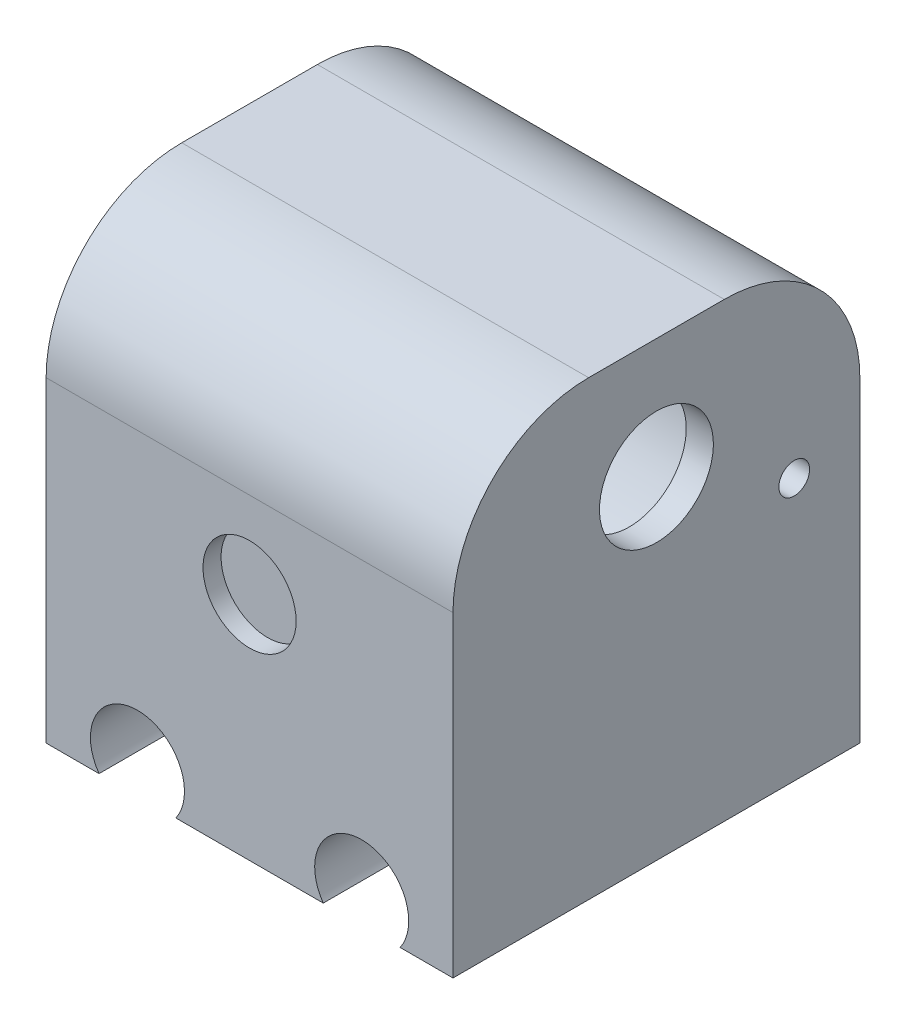
ISO-10303-21;
HEADER;
FILE_DESCRIPTION(('STEP AP214'),'2;1');
FILE_NAME('part.step','',(''),(''),'','','');
FILE_SCHEMA(('AUTOMOTIVE_DESIGN { 1 0 10303 214 1 1 1 1 }'));
ENDSEC;
DATA;
#1=APPLICATION_CONTEXT('core data for automotive mechanical design processes');
#2=APPLICATION_PROTOCOL_DEFINITION('international standard','automotive_design',2000,#1);
#3=PRODUCT_CONTEXT('',#1,'mechanical');
#4=PRODUCT('Part','Part','',(#3));
#5=PRODUCT_RELATED_PRODUCT_CATEGORY('part','',(#4));
#6=PRODUCT_DEFINITION_FORMATION('','',#4);
#7=PRODUCT_DEFINITION_CONTEXT('part definition',#1,'design');
#8=PRODUCT_DEFINITION('design','',#6,#7);
#9=PRODUCT_DEFINITION_SHAPE('','',#8);
#10=(LENGTH_UNIT() NAMED_UNIT(*) SI_UNIT(.MILLI.,.METRE.));
#11=(NAMED_UNIT(*) PLANE_ANGLE_UNIT() SI_UNIT($,.RADIAN.));
#12=(NAMED_UNIT(*) SI_UNIT($,.STERADIAN.) SOLID_ANGLE_UNIT());
#13=UNCERTAINTY_MEASURE_WITH_UNIT(LENGTH_MEASURE(1.E-05),#10,'distance_accuracy_value','');
#14=(GEOMETRIC_REPRESENTATION_CONTEXT(3) GLOBAL_UNCERTAINTY_ASSIGNED_CONTEXT((#13)) GLOBAL_UNIT_ASSIGNED_CONTEXT((#10,
#11,#12)) REPRESENTATION_CONTEXT('',''));
#15=CARTESIAN_POINT('',(0.,0.,0.));
#16=DIRECTION('',(0.,0.,1.));
#17=DIRECTION('',(1.,0.,0.));
#18=AXIS2_PLACEMENT_3D('',#15,#16,#17);
#19=CARTESIAN_POINT('',(-12.2633928571429,8.84821428571429,22.5));
#20=DIRECTION('',(1.,0.,0.));
#21=DIRECTION('',(0.,1.,0.));
#22=AXIS2_PLACEMENT_3D('',#19,#20,#21);
#23=CYLINDRICAL_SURFACE('',#22,6.3);
#24=CARTESIAN_POINT('',(27.7366071428571,8.8482142857143,22.5));
#25=DIRECTION('',(1.,0.,0.));
#26=DIRECTION('',(0.,1.,0.));
#27=AXIS2_PLACEMENT_3D('',#24,#25,#26);
#28=CIRCLE('',#27,6.3);
#29=CARTESIAN_POINT('',(27.7366071428571,15.1482142857143,22.5));
#30=VERTEX_POINT('',#29);
#31=EDGE_CURVE('E205',#30,#30,#28,.T.);
#32=ORIENTED_EDGE('',*,*,#31,.F.);
#33=EDGE_LOOP('',(#32));
#34=FACE_BOUND('',#33,.T.);
#35=CARTESIAN_POINT('',(30.7366071428572,8.8482142857143,22.5));
#36=DIRECTION('',(1.,0.,0.));
#37=DIRECTION('',(0.,1.,0.));
#38=AXIS2_PLACEMENT_3D('',#35,#36,#37);
#39=CIRCLE('',#38,6.3);
#40=CARTESIAN_POINT('',(30.7366071428572,15.1482142857143,22.5));
#41=VERTEX_POINT('',#40);
#42=EDGE_CURVE('E473',#41,#41,#39,.F.);
#43=ORIENTED_EDGE('',*,*,#42,.F.);
#44=EDGE_LOOP('',(#43));
#45=FACE_BOUND('',#44,.T.);
#46=ADVANCED_FACE('F41',(#34,#45),#23,.F.);
#47=CARTESIAN_POINT('',(32.7366071428572,1.09821428571429,7.25882025045361));
#48=DIRECTION('',(1.,0.,0.));
#49=DIRECTION('',(0.,1.,0.));
#50=AXIS2_PLACEMENT_3D('',#47,#48,#49);
#51=CYLINDRICAL_SURFACE('',#50,1.7);
#52=CARTESIAN_POINT('',(27.7366071428571,1.09821428571429,7.25882025045361));
#53=DIRECTION('',(1.,0.,0.));
#54=DIRECTION('',(0.,1.,0.));
#55=AXIS2_PLACEMENT_3D('',#52,#53,#54);
#56=CIRCLE('',#55,1.7);
#57=CARTESIAN_POINT('',(27.7366071428571,2.79821428571429,7.25882025045361));
#58=VERTEX_POINT('',#57);
#59=EDGE_CURVE('E210',#58,#58,#56,.T.);
#60=ORIENTED_EDGE('',*,*,#59,.F.);
#61=EDGE_LOOP('',(#60));
#62=FACE_BOUND('',#61,.T.);
#63=CARTESIAN_POINT('',(30.7366071428572,1.09821428571429,7.25882025045361));
#64=DIRECTION('',(1.,0.,0.));
#65=DIRECTION('',(0.,1.,0.));
#66=AXIS2_PLACEMENT_3D('',#63,#64,#65);
#67=CIRCLE('',#66,1.7);
#68=CARTESIAN_POINT('',(30.7366071428572,2.79821428571429,7.25882025045361));
#69=VERTEX_POINT('',#68);
#70=EDGE_CURVE('E45',#69,#69,#67,.F.);
#71=ORIENTED_EDGE('',*,*,#70,.F.);
#72=EDGE_LOOP('',(#71));
#73=FACE_BOUND('',#72,.T.);
#74=ADVANCED_FACE('F257',(#62,#73),#51,.F.);
#75=CARTESIAN_POINT('',(35.7366071428571,1.09821428571429,22.5));
#76=DIRECTION('',(-1.,0.,0.));
#77=DIRECTION('',(0.,-1.,0.));
#78=AXIS2_PLACEMENT_3D('',#75,#76,#77);
#79=CYLINDRICAL_SURFACE('',#78,18.75);
#80=CARTESIAN_POINT('',(-14.2633928571429,1.09821428571429,22.5));
#81=DIRECTION('',(-1.,0.,0.));
#82=DIRECTION('',(0.,-1.,0.));
#83=AXIS2_PLACEMENT_3D('',#80,#81,#82);
#84=CIRCLE('',#83,18.75);
#85=CARTESIAN_POINT('',(-14.2633928571429,-17.6517857142857,22.5));
#86=VERTEX_POINT('',#85);
#87=EDGE_CURVE('E207',#86,#86,#84,.T.);
#88=ORIENTED_EDGE('',*,*,#87,.T.);
#89=EDGE_LOOP('',(#88));
#90=FACE_BOUND('',#89,.T.);
#91=CARTESIAN_POINT('',(27.7366071428571,1.09821428571429,22.5));
#92=DIRECTION('',(1.,0.,0.));
#93=DIRECTION('',(0.,1.,0.));
#94=AXIS2_PLACEMENT_3D('',#91,#92,#93);
#95=CIRCLE('',#94,18.75);
#96=CARTESIAN_POINT('',(27.7366071428571,19.8482142857143,22.5));
#97=VERTEX_POINT('',#96);
#98=EDGE_CURVE('E11',#97,#97,#95,.F.);
#99=ORIENTED_EDGE('',*,*,#98,.F.);
#100=EDGE_LOOP('',(#99));
#101=FACE_BOUND('',#100,.T.);
#102=ADVANCED_FACE('F263',(#90,#101),#79,.F.);
#103=CARTESIAN_POINT('',(-14.2633928571429,-27.9017857142857,45.));
#104=DIRECTION('',(0.,1.,0.));
#105=DIRECTION('',(0.,0.,1.));
#106=AXIS2_PLACEMENT_3D('',#103,#104,#105);
#107=PLANE('',#106);
#108=DIRECTION('',(1.,0.,0.));
#109=VECTOR('',#108,1.);
#110=CARTESIAN_POINT('',(-14.2633928571429,-27.9017857142857,0.));
#111=LINE('',#110,#109);
#112=CARTESIAN_POINT('',(-14.2633928571429,-27.9017857142857,0.));
#113=VERTEX_POINT('',#112);
#114=CARTESIAN_POINT('',(-8.41074497346191,-27.9017857142857,0.));
#115=VERTEX_POINT('',#114);
#116=EDGE_CURVE('E147',#113,#115,#111,.T.);
#117=ORIENTED_EDGE('',*,*,#116,.T.);
#118=DIRECTION('',(0.,0.,1.));
#119=VECTOR('',#118,1.);
#120=CARTESIAN_POINT('',(-8.41074497346191,-27.9017857142857,0.));
#121=LINE('',#120,#119);
#122=CARTESIAN_POINT('',(-8.41074497346191,-27.9017857142857,45.));
#123=VERTEX_POINT('',#122);
#124=EDGE_CURVE('E148',#115,#123,#121,.T.);
#125=ORIENTED_EDGE('',*,*,#124,.T.);
#126=DIRECTION('',(1.,0.,0.));
#127=VECTOR('',#126,1.);
#128=CARTESIAN_POINT('',(-14.2633928571429,-27.9017857142857,45.));
#129=LINE('',#128,#127);
#130=CARTESIAN_POINT('',(-14.2633928571429,-27.9017857142857,45.));
#131=VERTEX_POINT('',#130);
#132=EDGE_CURVE('E193',#131,#123,#129,.T.);
#133=ORIENTED_EDGE('',*,*,#132,.F.);
#134=DIRECTION('',(0.,0.,-1.));
#135=VECTOR('',#134,1.);
#136=CARTESIAN_POINT('',(-14.2633928571429,-27.9017857142857,45.));
#137=LINE('',#136,#135);
#138=EDGE_CURVE('E131',#131,#113,#137,.T.);
#139=ORIENTED_EDGE('',*,*,#138,.T.);
#140=EDGE_LOOP('',(#117,#125,#133,#139));
#141=FACE_BOUND('',#140,.T.);
#142=ADVANCED_FACE('F245',(#141),#107,.F.);
#143=CARTESIAN_POINT('',(0.0839592591762011,-27.9017857142857,45.));
#144=VERTEX_POINT('',#143);
#145=CARTESIAN_POINT('',(16.3892550265381,-27.9017857142857,45.));
#146=VERTEX_POINT('',#145);
#147=EDGE_CURVE('E236',#144,#146,#129,.T.);
#148=ORIENTED_EDGE('',*,*,#147,.F.);
#149=DIRECTION('',(0.,0.,1.));
#150=VECTOR('',#149,1.);
#151=CARTESIAN_POINT('',(0.0839592591762002,-27.9017857142857,0.));
#152=LINE('',#151,#150);
#153=CARTESIAN_POINT('',(0.0839592591762011,-27.9017857142857,0.));
#154=VERTEX_POINT('',#153);
#155=EDGE_CURVE('E231',#144,#154,#152,.F.);
#156=ORIENTED_EDGE('',*,*,#155,.T.);
#157=CARTESIAN_POINT('',(16.3892550265381,-27.9017857142857,0.));
#158=VERTEX_POINT('',#157);
#159=EDGE_CURVE('E144',#154,#158,#111,.T.);
#160=ORIENTED_EDGE('',*,*,#159,.T.);
#161=DIRECTION('',(0.,0.,1.));
#162=VECTOR('',#161,1.);
#163=CARTESIAN_POINT('',(16.3892550265381,-27.9017857142857,0.));
#164=LINE('',#163,#162);
#165=EDGE_CURVE('E126',#158,#146,#164,.T.);
#166=ORIENTED_EDGE('',*,*,#165,.T.);
#167=EDGE_LOOP('',(#148,#156,#160,#166));
#168=FACE_BOUND('',#167,.T.);
#169=ADVANCED_FACE('F242',(#168),#107,.F.);
#170=CARTESIAN_POINT('',(-14.2633928571429,22.0982142857143,45.));
#171=DIRECTION('',(1.,0.,0.));
#172=DIRECTION('',(0.,1.,0.));
#173=AXIS2_PLACEMENT_3D('',#170,#171,#172);
#174=PLANE('',#173);
#175=ORIENTED_EDGE('',*,*,#87,.F.);
#176=EDGE_LOOP('',(#175));
#177=FACE_BOUND('',#176,.T.);
#178=DIRECTION('',(0.,-1.,0.));
#179=VECTOR('',#178,1.);
#180=CARTESIAN_POINT('',(-14.2633928571429,22.0982142857143,45.));
#181=LINE('',#180,#179);
#182=CARTESIAN_POINT('',(-14.2633928571429,7.09821428571429,45.));
#183=VERTEX_POINT('',#182);
#184=EDGE_CURVE('E156',#183,#131,#181,.T.);
#185=ORIENTED_EDGE('',*,*,#184,.F.);
#186=CARTESIAN_POINT('',(-14.2633928571429,7.09821428571429,30.));
#187=DIRECTION('',(1.,0.,0.));
#188=DIRECTION('',(0.,1.,0.));
#189=AXIS2_PLACEMENT_3D('',#186,#187,#188);
#190=CIRCLE('',#189,15.);
#191=CARTESIAN_POINT('',(-14.2633928571429,22.0982142857143,30.));
#192=VERTEX_POINT('',#191);
#193=EDGE_CURVE('E170',#183,#192,#190,.F.);
#194=ORIENTED_EDGE('',*,*,#193,.T.);
#195=DIRECTION('',(0.,0.,-1.));
#196=VECTOR('',#195,1.);
#197=CARTESIAN_POINT('',(-14.2633928571429,22.0982142857143,0.));
#198=LINE('',#197,#196);
#199=CARTESIAN_POINT('',(-14.2633928571429,22.0982142857143,15.));
#200=VERTEX_POINT('',#199);
#201=EDGE_CURVE('E200',#192,#200,#198,.T.);
#202=ORIENTED_EDGE('',*,*,#201,.T.);
#203=CARTESIAN_POINT('',(-14.2633928571429,7.09821428571429,15.));
#204=DIRECTION('',(1.,0.,0.));
#205=DIRECTION('',(0.,1.,0.));
#206=AXIS2_PLACEMENT_3D('',#203,#204,#205);
#207=CIRCLE('',#206,15.);
#208=CARTESIAN_POINT('',(-14.2633928571429,7.09821428571429,0.));
#209=VERTEX_POINT('',#208);
#210=EDGE_CURVE('E168',#200,#209,#207,.F.);
#211=ORIENTED_EDGE('',*,*,#210,.T.);
#212=DIRECTION('',(0.,-1.,0.));
#213=VECTOR('',#212,1.);
#214=CARTESIAN_POINT('',(-14.2633928571429,22.0982142857143,0.));
#215=LINE('',#214,#213);
#216=EDGE_CURVE('E145',#209,#113,#215,.T.);
#217=ORIENTED_EDGE('',*,*,#216,.T.);
#218=ORIENTED_EDGE('',*,*,#138,.F.);
#219=EDGE_LOOP('',(#185,#194,#202,#211,#217,#218));
#220=FACE_BOUND('',#219,.T.);
#221=ADVANCED_FACE('F199',(#177,#220),#174,.F.);
#222=CARTESIAN_POINT('',(24.8839592591762,-27.9017857142857,45.));
#223=VERTEX_POINT('',#222);
#224=CARTESIAN_POINT('',(30.7366071428571,-27.9017857142857,45.));
#225=VERTEX_POINT('',#224);
#226=EDGE_CURVE('E139',#223,#225,#129,.T.);
#227=ORIENTED_EDGE('',*,*,#226,.F.);
#228=DIRECTION('',(0.,0.,1.));
#229=VECTOR('',#228,1.);
#230=CARTESIAN_POINT('',(24.8839592591762,-27.9017857142857,0.));
#231=LINE('',#230,#229);
#232=CARTESIAN_POINT('',(24.8839592591762,-27.9017857142857,0.));
#233=VERTEX_POINT('',#232);
#234=EDGE_CURVE('E123',#223,#233,#231,.F.);
#235=ORIENTED_EDGE('',*,*,#234,.T.);
#236=CARTESIAN_POINT('',(30.7366071428571,-27.9017857142857,0.));
#237=VERTEX_POINT('',#236);
#238=EDGE_CURVE('E137',#233,#237,#111,.T.);
#239=ORIENTED_EDGE('',*,*,#238,.T.);
#240=DIRECTION('',(0.,0.,-1.));
#241=VECTOR('',#240,1.);
#242=CARTESIAN_POINT('',(30.7366071428571,-27.9017857142857,45.));
#243=LINE('',#242,#241);
#244=EDGE_CURVE('E159',#225,#237,#243,.T.);
#245=ORIENTED_EDGE('',*,*,#244,.F.);
#246=EDGE_LOOP('',(#227,#235,#239,#245));
#247=FACE_BOUND('',#246,.T.);
#248=ADVANCED_FACE('F135',(#247),#107,.F.);
#249=CARTESIAN_POINT('',(30.7366071428571,22.0982142857143,45.));
#250=DIRECTION('',(-1.,0.,0.));
#251=DIRECTION('',(0.,-1.,0.));
#252=AXIS2_PLACEMENT_3D('',#249,#250,#251);
#253=PLANE('',#252);
#254=DIRECTION('',(0.,0.,-1.));
#255=VECTOR('',#254,1.);
#256=CARTESIAN_POINT('',(30.7366071428571,22.0982142857143,0.));
#257=LINE('',#256,#255);
#258=CARTESIAN_POINT('',(30.7366071428571,22.0982142857143,30.));
#259=VERTEX_POINT('',#258);
#260=CARTESIAN_POINT('',(30.7366071428571,22.0982142857143,15.));
#261=VERTEX_POINT('',#260);
#262=EDGE_CURVE('E185',#259,#261,#257,.T.);
#263=ORIENTED_EDGE('',*,*,#262,.F.);
#264=CARTESIAN_POINT('',(30.7366071428571,7.0982142857143,30.));
#265=DIRECTION('',(-1.,0.,0.));
#266=DIRECTION('',(0.,-1.,0.));
#267=AXIS2_PLACEMENT_3D('',#264,#265,#266);
#268=CIRCLE('',#267,15.);
#269=CARTESIAN_POINT('',(30.7366071428571,7.09821428571429,45.));
#270=VERTEX_POINT('',#269);
#271=EDGE_CURVE('E178',#259,#270,#268,.F.);
#272=ORIENTED_EDGE('',*,*,#271,.T.);
#273=DIRECTION('',(0.,1.,0.));
#274=VECTOR('',#273,1.);
#275=CARTESIAN_POINT('',(30.7366071428571,22.0982142857143,45.));
#276=LINE('',#275,#274);
#277=EDGE_CURVE('E161',#225,#270,#276,.T.);
#278=ORIENTED_EDGE('',*,*,#277,.F.);
#279=ORIENTED_EDGE('',*,*,#244,.T.);
#280=DIRECTION('',(0.,1.,0.));
#281=VECTOR('',#280,1.);
#282=CARTESIAN_POINT('',(30.7366071428571,22.0982142857143,0.));
#283=LINE('',#282,#281);
#284=CARTESIAN_POINT('',(30.7366071428571,7.0982142857143,0.));
#285=VERTEX_POINT('',#284);
#286=EDGE_CURVE('E143',#237,#285,#283,.T.);
#287=ORIENTED_EDGE('',*,*,#286,.T.);
#288=CARTESIAN_POINT('',(30.7366071428571,7.0982142857143,15.));
#289=DIRECTION('',(-1.,0.,0.));
#290=DIRECTION('',(0.,-1.,0.));
#291=AXIS2_PLACEMENT_3D('',#288,#289,#290);
#292=CIRCLE('',#291,15.);
#293=EDGE_CURVE('E63',#285,#261,#292,.F.);
#294=ORIENTED_EDGE('',*,*,#293,.T.);
#295=EDGE_LOOP('',(#263,#272,#278,#279,#287,#294));
#296=FACE_BOUND('',#295,.T.);
#297=ORIENTED_EDGE('',*,*,#70,.T.);
#298=EDGE_LOOP('',(#297));
#299=FACE_BOUND('',#298,.T.);
#300=ORIENTED_EDGE('',*,*,#42,.T.);
#301=EDGE_LOOP('',(#300));
#302=FACE_BOUND('',#301,.T.);
#303=ADVANCED_FACE('F183',(#296,#299,#302),#253,.F.);
#304=CARTESIAN_POINT('',(0.,0.,45.));
#305=DIRECTION('',(0.,0.,1.));
#306=DIRECTION('',(1.,0.,0.));
#307=AXIS2_PLACEMENT_3D('',#304,#305,#306);
#308=PLANE('',#307);
#309=ORIENTED_EDGE('',*,*,#277,.T.);
#310=DIRECTION('',(-1.,0.,0.));
#311=VECTOR('',#310,1.);
#312=CARTESIAN_POINT('',(0.,7.09821428571429,45.));
#313=LINE('',#312,#311);
#314=EDGE_CURVE('E165',#270,#183,#313,.T.);
#315=ORIENTED_EDGE('',*,*,#314,.T.);
#316=ORIENTED_EDGE('',*,*,#184,.T.);
#317=ORIENTED_EDGE('',*,*,#132,.T.);
#318=CARTESIAN_POINT('',(-4.16339285714286,-24.9017857142857,45.));
#319=DIRECTION('',(0.,0.,1.));
#320=DIRECTION('',(1.,0.,0.));
#321=AXIS2_PLACEMENT_3D('',#318,#319,#320);
#322=CIRCLE('',#321,5.2);
#323=EDGE_CURVE('E140',#144,#123,#322,.T.);
#324=ORIENTED_EDGE('',*,*,#323,.F.);
#325=ORIENTED_EDGE('',*,*,#147,.T.);
#326=CARTESIAN_POINT('',(20.6366071428571,-24.9017857142857,45.));
#327=DIRECTION('',(0.,0.,1.));
#328=DIRECTION('',(1.,0.,0.));
#329=AXIS2_PLACEMENT_3D('',#326,#327,#328);
#330=CIRCLE('',#329,5.2);
#331=EDGE_CURVE('E225',#223,#146,#330,.T.);
#332=ORIENTED_EDGE('',*,*,#331,.F.);
#333=ORIENTED_EDGE('',*,*,#226,.T.);
#334=EDGE_LOOP('',(#309,#315,#316,#317,#324,#325,#332,#333));
#335=FACE_BOUND('',#334,.T.);
#336=CARTESIAN_POINT('',(8.23660714285715,-2.40178571428571,45.));
#337=DIRECTION('',(0.,0.,1.));
#338=DIRECTION('',(1.,0.,0.));
#339=AXIS2_PLACEMENT_3D('',#336,#337,#338);
#340=CIRCLE('',#339,5.15);
#341=CARTESIAN_POINT('',(13.3866071428572,-2.40178571428571,45.));
#342=VERTEX_POINT('',#341);
#343=EDGE_CURVE('E219',#342,#342,#340,.T.);
#344=ORIENTED_EDGE('',*,*,#343,.F.);
#345=EDGE_LOOP('',(#344));
#346=FACE_BOUND('',#345,.T.);
#347=ADVANCED_FACE('F190',(#335,#346),#308,.T.);
#348=CARTESIAN_POINT('',(0.,0.,0.));
#349=DIRECTION('',(0.,0.,1.));
#350=DIRECTION('',(1.,0.,0.));
#351=AXIS2_PLACEMENT_3D('',#348,#349,#350);
#352=PLANE('',#351);
#353=CARTESIAN_POINT('',(8.23660714285714,-2.40178571428571,0.));
#354=DIRECTION('',(0.,0.,-1.));
#355=DIRECTION('',(-1.,0.,0.));
#356=AXIS2_PLACEMENT_3D('',#353,#354,#355);
#357=CIRCLE('',#356,5.15);
#358=CARTESIAN_POINT('',(3.08660714285714,-2.40178571428571,0.));
#359=VERTEX_POINT('',#358);
#360=EDGE_CURVE('E215',#359,#359,#357,.T.);
#361=ORIENTED_EDGE('',*,*,#360,.F.);
#362=EDGE_LOOP('',(#361));
#363=FACE_BOUND('',#362,.T.);
#364=ORIENTED_EDGE('',*,*,#216,.F.);
#365=DIRECTION('',(-1.,0.,0.));
#366=VECTOR('',#365,1.);
#367=CARTESIAN_POINT('',(30.7366071428571,7.0982142857143,0.));
#368=LINE('',#367,#366);
#369=EDGE_CURVE('E50',#209,#285,#368,.F.);
#370=ORIENTED_EDGE('',*,*,#369,.T.);
#371=ORIENTED_EDGE('',*,*,#286,.F.);
#372=ORIENTED_EDGE('',*,*,#238,.F.);
#373=CARTESIAN_POINT('',(20.6366071428571,-24.9017857142857,0.));
#374=DIRECTION('',(0.,0.,1.));
#375=DIRECTION('',(1.,0.,0.));
#376=AXIS2_PLACEMENT_3D('',#373,#374,#375);
#377=CIRCLE('',#376,5.2);
#378=EDGE_CURVE('E120',#233,#158,#377,.T.);
#379=ORIENTED_EDGE('',*,*,#378,.T.);
#380=ORIENTED_EDGE('',*,*,#159,.F.);
#381=CARTESIAN_POINT('',(-4.16339285714286,-24.9017857142857,0.));
#382=DIRECTION('',(0.,0.,1.));
#383=DIRECTION('',(1.,0.,0.));
#384=AXIS2_PLACEMENT_3D('',#381,#382,#383);
#385=CIRCLE('',#384,5.2);
#386=EDGE_CURVE('E130',#154,#115,#385,.T.);
#387=ORIENTED_EDGE('',*,*,#386,.T.);
#388=ORIENTED_EDGE('',*,*,#116,.F.);
#389=EDGE_LOOP('',(#364,#370,#371,#372,#379,#380,#387,#388));
#390=FACE_BOUND('',#389,.T.);
#391=ADVANCED_FACE('F142',(#363,#390),#352,.F.);
#392=CARTESIAN_POINT('',(20.6366071428571,-24.9017857142857,0.));
#393=DIRECTION('',(0.,0.,1.));
#394=DIRECTION('',(1.,0.,0.));
#395=AXIS2_PLACEMENT_3D('',#392,#393,#394);
#396=CYLINDRICAL_SURFACE('',#395,5.2);
#397=ORIENTED_EDGE('',*,*,#378,.F.);
#398=ORIENTED_EDGE('',*,*,#234,.F.);
#399=ORIENTED_EDGE('',*,*,#331,.T.);
#400=ORIENTED_EDGE('',*,*,#165,.F.);
#401=EDGE_LOOP('',(#397,#398,#399,#400));
#402=FACE_BOUND('',#401,.T.);
#403=ADVANCED_FACE('F122',(#402),#396,.F.);
#404=CARTESIAN_POINT('',(-4.16339285714286,-24.9017857142857,0.));
#405=DIRECTION('',(0.,0.,1.));
#406=DIRECTION('',(1.,0.,0.));
#407=AXIS2_PLACEMENT_3D('',#404,#405,#406);
#408=CYLINDRICAL_SURFACE('',#407,5.2);
#409=ORIENTED_EDGE('',*,*,#386,.F.);
#410=ORIENTED_EDGE('',*,*,#155,.F.);
#411=ORIENTED_EDGE('',*,*,#323,.T.);
#412=ORIENTED_EDGE('',*,*,#124,.F.);
#413=EDGE_LOOP('',(#409,#410,#411,#412));
#414=FACE_BOUND('',#413,.T.);
#415=ADVANCED_FACE('F244',(#414),#408,.F.);
#416=CARTESIAN_POINT('',(8.23660714285715,-2.40178571428571,43.));
#417=DIRECTION('',(0.,0.,1.));
#418=DIRECTION('',(1.,0.,0.));
#419=AXIS2_PLACEMENT_3D('',#416,#417,#418);
#420=CYLINDRICAL_SURFACE('',#419,5.15);
#421=CARTESIAN_POINT('',(8.23660714285715,-2.40178571428571,43.));
#422=DIRECTION('',(0.,0.,1.));
#423=DIRECTION('',(1.,0.,0.));
#424=AXIS2_PLACEMENT_3D('',#421,#422,#423);
#425=CIRCLE('',#424,5.15);
#426=CARTESIAN_POINT('',(13.3866071428572,-2.40178571428571,43.));
#427=VERTEX_POINT('',#426);
#428=EDGE_CURVE('E222',#427,#427,#425,.T.);
#429=ORIENTED_EDGE('',*,*,#428,.F.);
#430=EDGE_LOOP('',(#429));
#431=FACE_BOUND('',#430,.T.);
#432=ORIENTED_EDGE('',*,*,#343,.T.);
#433=EDGE_LOOP('',(#432));
#434=FACE_BOUND('',#433,.T.);
#435=ADVANCED_FACE('F285',(#431,#434),#420,.F.);
#436=CARTESIAN_POINT('',(8.23660714285715,-2.40178571428571,43.));
#437=DIRECTION('',(0.,0.,1.));
#438=DIRECTION('',(1.,0.,0.));
#439=AXIS2_PLACEMENT_3D('',#436,#437,#438);
#440=PLANE('',#439);
#441=ORIENTED_EDGE('',*,*,#428,.T.);
#442=EDGE_LOOP('',(#441));
#443=FACE_BOUND('',#442,.T.);
#444=ADVANCED_FACE('F281',(#443),#440,.T.);
#445=CARTESIAN_POINT('',(8.23660714285714,-2.40178571428571,2.));
#446=DIRECTION('',(0.,0.,-1.));
#447=DIRECTION('',(-1.,0.,0.));
#448=AXIS2_PLACEMENT_3D('',#445,#446,#447);
#449=CYLINDRICAL_SURFACE('',#448,5.15);
#450=CARTESIAN_POINT('',(8.23660714285714,-2.40178571428571,2.));
#451=DIRECTION('',(0.,0.,-1.));
#452=DIRECTION('',(-1.,0.,0.));
#453=AXIS2_PLACEMENT_3D('',#450,#451,#452);
#454=CIRCLE('',#453,5.15);
#455=CARTESIAN_POINT('',(3.08660714285714,-2.40178571428571,2.));
#456=VERTEX_POINT('',#455);
#457=EDGE_CURVE('E216',#456,#456,#454,.T.);
#458=ORIENTED_EDGE('',*,*,#457,.F.);
#459=EDGE_LOOP('',(#458));
#460=FACE_BOUND('',#459,.T.);
#461=ORIENTED_EDGE('',*,*,#360,.T.);
#462=EDGE_LOOP('',(#461));
#463=FACE_BOUND('',#462,.T.);
#464=ADVANCED_FACE('F277',(#460,#463),#449,.F.);
#465=CARTESIAN_POINT('',(8.23660714285714,-2.40178571428571,2.));
#466=DIRECTION('',(0.,0.,-1.));
#467=DIRECTION('',(-1.,0.,0.));
#468=AXIS2_PLACEMENT_3D('',#465,#466,#467);
#469=PLANE('',#468);
#470=ORIENTED_EDGE('',*,*,#457,.T.);
#471=EDGE_LOOP('',(#470));
#472=FACE_BOUND('',#471,.T.);
#473=ADVANCED_FACE('F271',(#472),#469,.T.);
#474=CARTESIAN_POINT('',(30.7366071428571,22.0982142857143,0.));
#475=DIRECTION('',(0.,1.,0.));
#476=DIRECTION('',(-1.,0.,0.));
#477=AXIS2_PLACEMENT_3D('',#474,#475,#476);
#478=PLANE('',#477);
#479=ORIENTED_EDGE('',*,*,#201,.F.);
#480=DIRECTION('',(-1.,0.,0.));
#481=VECTOR('',#480,1.);
#482=CARTESIAN_POINT('',(30.7366071428571,22.0982142857143,30.));
#483=LINE('',#482,#481);
#484=EDGE_CURVE('E175',#192,#259,#483,.F.);
#485=ORIENTED_EDGE('',*,*,#484,.T.);
#486=ORIENTED_EDGE('',*,*,#262,.T.);
#487=DIRECTION('',(-1.,0.,0.));
#488=VECTOR('',#487,1.);
#489=CARTESIAN_POINT('',(-14.2633928571429,22.0982142857143,15.));
#490=LINE('',#489,#488);
#491=EDGE_CURVE('E172',#261,#200,#490,.T.);
#492=ORIENTED_EDGE('',*,*,#491,.T.);
#493=EDGE_LOOP('',(#479,#485,#486,#492));
#494=FACE_BOUND('',#493,.T.);
#495=ADVANCED_FACE('F203',(#494),#478,.T.);
#496=CARTESIAN_POINT('',(0.,7.09821428571429,30.));
#497=DIRECTION('',(-1.,0.,0.));
#498=DIRECTION('',(0.,-1.,0.));
#499=AXIS2_PLACEMENT_3D('',#496,#497,#498);
#500=CYLINDRICAL_SURFACE('',#499,15.);
#501=ORIENTED_EDGE('',*,*,#271,.F.);
#502=ORIENTED_EDGE('',*,*,#484,.F.);
#503=ORIENTED_EDGE('',*,*,#193,.F.);
#504=ORIENTED_EDGE('',*,*,#314,.F.);
#505=EDGE_LOOP('',(#501,#502,#503,#504));
#506=FACE_BOUND('',#505,.T.);
#507=ADVANCED_FACE('F195',(#506),#500,.T.);
#508=CARTESIAN_POINT('',(30.7366071428571,7.0982142857143,15.));
#509=DIRECTION('',(1.,0.,0.));
#510=DIRECTION('',(0.,1.,0.));
#511=AXIS2_PLACEMENT_3D('',#508,#509,#510);
#512=CYLINDRICAL_SURFACE('',#511,15.);
#513=ORIENTED_EDGE('',*,*,#293,.F.);
#514=ORIENTED_EDGE('',*,*,#369,.F.);
#515=ORIENTED_EDGE('',*,*,#210,.F.);
#516=ORIENTED_EDGE('',*,*,#491,.F.);
#517=EDGE_LOOP('',(#513,#514,#515,#516));
#518=FACE_BOUND('',#517,.T.);
#519=ADVANCED_FACE('F43',(#518),#512,.T.);
#520=CARTESIAN_POINT('',(27.7366071428571,1.09821428571429,22.5));
#521=DIRECTION('',(1.,0.,0.));
#522=DIRECTION('',(0.,1.,0.));
#523=AXIS2_PLACEMENT_3D('',#520,#521,#522);
#524=PLANE('',#523);
#525=ORIENTED_EDGE('',*,*,#31,.T.);
#526=EDGE_LOOP('',(#525));
#527=FACE_BOUND('',#526,.T.);
#528=ORIENTED_EDGE('',*,*,#59,.T.);
#529=EDGE_LOOP('',(#528));
#530=FACE_BOUND('',#529,.T.);
#531=ORIENTED_EDGE('',*,*,#98,.T.);
#532=EDGE_LOOP('',(#531));
#533=FACE_BOUND('',#532,.T.);
#534=ADVANCED_FACE('F248',(#527,#530,#533),#524,.F.);
#535=CLOSED_SHELL('',(#46,#74,#102,#142,#169,#221,#248,#303,#347,#391,#403,#415,#435,#444,#464,
#473,#495,#507,#519,#534));
#536=MANIFOLD_SOLID_BREP('B2',#535);
#537=ADVANCED_BREP_SHAPE_REPRESENTATION('',(#18,#536),#14);
#538=SHAPE_DEFINITION_REPRESENTATION(#9,#537);
ENDSEC;
END-ISO-10303-21;
